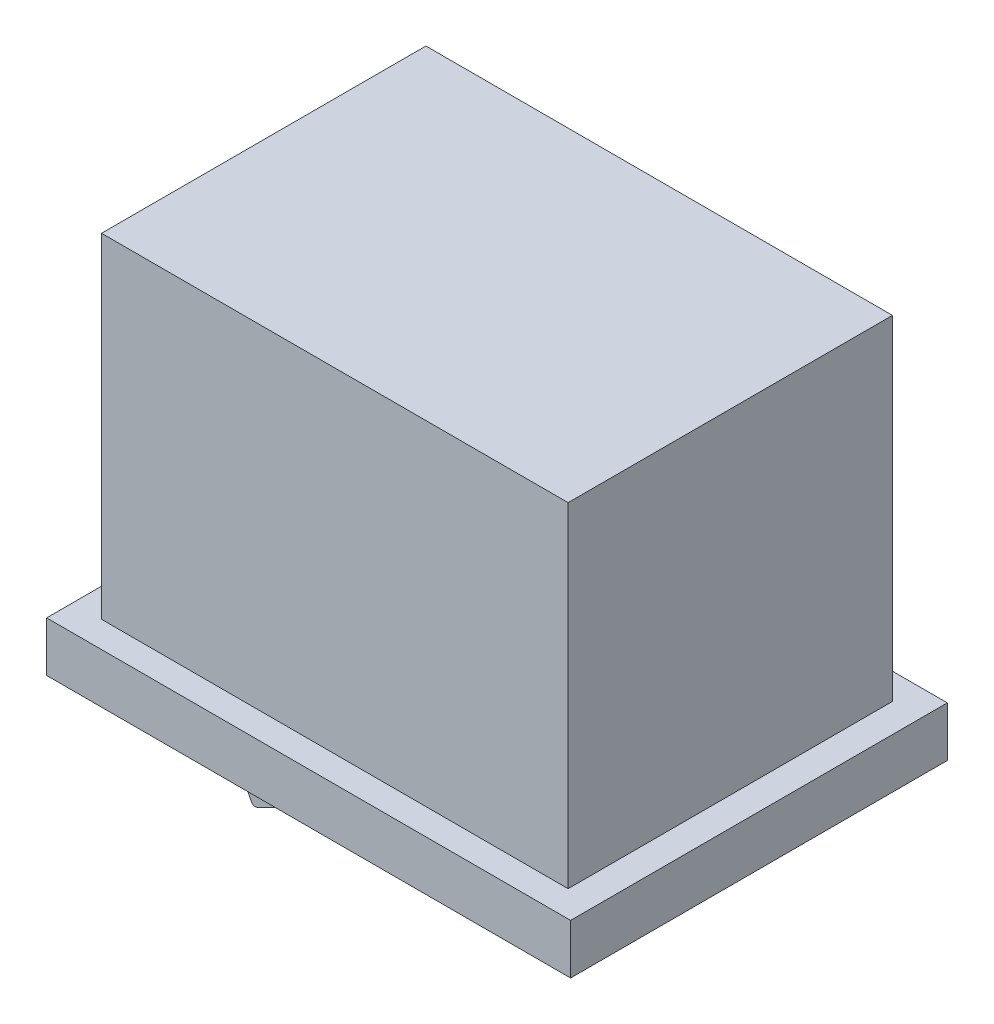
ISO-10303-21;
HEADER;
FILE_DESCRIPTION(('STEP AP214'),'2;1');
FILE_NAME('part.step','',(''),(''),'','','');
FILE_SCHEMA(('AUTOMOTIVE_DESIGN { 1 0 10303 214 1 1 1 1 }'));
ENDSEC;
DATA;
#1=APPLICATION_CONTEXT('core data for automotive mechanical design processes');
#2=APPLICATION_PROTOCOL_DEFINITION('international standard','automotive_design',2000,#1);
#3=PRODUCT_CONTEXT('',#1,'mechanical');
#4=PRODUCT('Part','Part','',(#3));
#5=PRODUCT_RELATED_PRODUCT_CATEGORY('part','',(#4));
#6=PRODUCT_DEFINITION_FORMATION('','',#4);
#7=PRODUCT_DEFINITION_CONTEXT('part definition',#1,'design');
#8=PRODUCT_DEFINITION('design','',#6,#7);
#9=PRODUCT_DEFINITION_SHAPE('','',#8);
#10=(LENGTH_UNIT() NAMED_UNIT(*) SI_UNIT(.MILLI.,.METRE.));
#11=(NAMED_UNIT(*) PLANE_ANGLE_UNIT() SI_UNIT($,.RADIAN.));
#12=(NAMED_UNIT(*) SI_UNIT($,.STERADIAN.) SOLID_ANGLE_UNIT());
#13=UNCERTAINTY_MEASURE_WITH_UNIT(LENGTH_MEASURE(1.E-05),#10,'distance_accuracy_value','');
#14=(GEOMETRIC_REPRESENTATION_CONTEXT(3) GLOBAL_UNCERTAINTY_ASSIGNED_CONTEXT((#13)) GLOBAL_UNIT_ASSIGNED_CONTEXT((#10,
#11,#12)) REPRESENTATION_CONTEXT('',''));
#15=CARTESIAN_POINT('',(0.,0.,0.));
#16=DIRECTION('',(0.,0.,1.));
#17=DIRECTION('',(1.,0.,0.));
#18=AXIS2_PLACEMENT_3D('',#15,#16,#17);
#19=CARTESIAN_POINT('',(0.,-15.4,15.1));
#20=DIRECTION('',(0.,1.,0.));
#21=DIRECTION('',(0.,0.,1.));
#22=AXIS2_PLACEMENT_3D('',#19,#20,#21);
#23=PLANE('',#22);
#24=DIRECTION('',(0.,0.,-1.));
#25=VECTOR('',#24,1.);
#26=CARTESIAN_POINT('',(21.,-15.4,15.1));
#27=LINE('',#26,#25);
#28=CARTESIAN_POINT('',(21.,-15.4,15.1));
#29=VERTEX_POINT('',#28);
#30=CARTESIAN_POINT('',(21.,-15.4,0.));
#31=VERTEX_POINT('',#30);
#32=EDGE_CURVE('E235',#29,#31,#27,.T.);
#33=ORIENTED_EDGE('',*,*,#32,.F.);
#34=DIRECTION('',(1.,0.,0.));
#35=VECTOR('',#34,1.);
#36=CARTESIAN_POINT('',(0.,-15.4,15.1));
#37=LINE('',#36,#35);
#38=CARTESIAN_POINT('',(0.,-15.4,15.1));
#39=VERTEX_POINT('',#38);
#40=EDGE_CURVE('E227',#39,#29,#37,.T.);
#41=ORIENTED_EDGE('',*,*,#40,.F.);
#42=DIRECTION('',(0.,0.,-1.));
#43=VECTOR('',#42,1.);
#44=CARTESIAN_POINT('',(0.,-15.4,15.1));
#45=LINE('',#44,#43);
#46=CARTESIAN_POINT('',(0.,-15.4,0.));
#47=VERTEX_POINT('',#46);
#48=EDGE_CURVE('E247',#39,#47,#45,.T.);
#49=ORIENTED_EDGE('',*,*,#48,.T.);
#50=DIRECTION('',(1.,0.,0.));
#51=VECTOR('',#50,1.);
#52=CARTESIAN_POINT('',(0.,-15.4,0.));
#53=LINE('',#52,#51);
#54=EDGE_CURVE('E238',#47,#31,#53,.T.);
#55=ORIENTED_EDGE('',*,*,#54,.T.);
#56=EDGE_LOOP('',(#33,#41,#49,#55));
#57=FACE_BOUND('',#56,.T.);
#58=DIRECTION('',(-1.,0.,0.));
#59=VECTOR('',#58,1.);
#60=CARTESIAN_POINT('',(1.5,-15.4,12.55));
#61=LINE('',#60,#59);
#62=CARTESIAN_POINT('',(17.2006718763527,-15.4,12.55));
#63=VERTEX_POINT('',#62);
#64=CARTESIAN_POINT('',(4.31818788753446,-15.4,12.55));
#65=VERTEX_POINT('',#64);
#66=EDGE_CURVE('E160',#63,#65,#61,.T.);
#67=ORIENTED_EDGE('',*,*,#66,.F.);
#68=DIRECTION('',(0.,0.,-1.));
#69=VECTOR('',#68,1.);
#70=CARTESIAN_POINT('',(17.2006718763527,-15.4,15.1));
#71=LINE('',#70,#69);
#72=CARTESIAN_POINT('',(17.2006718763527,-15.4,2.55));
#73=VERTEX_POINT('',#72);
#74=EDGE_CURVE('E157',#63,#73,#71,.T.);
#75=ORIENTED_EDGE('',*,*,#74,.T.);
#76=DIRECTION('',(1.,0.,0.));
#77=VECTOR('',#76,1.);
#78=CARTESIAN_POINT('',(1.5,-15.4,2.55));
#79=LINE('',#78,#77);
#80=CARTESIAN_POINT('',(4.31818788753446,-15.4,2.55));
#81=VERTEX_POINT('',#80);
#82=EDGE_CURVE('E152',#81,#73,#79,.T.);
#83=ORIENTED_EDGE('',*,*,#82,.F.);
#84=DIRECTION('',(0.,0.,-1.));
#85=VECTOR('',#84,1.);
#86=CARTESIAN_POINT('',(4.31818788753446,-15.4,15.1));
#87=LINE('',#86,#85);
#88=EDGE_CURVE('E134',#65,#81,#87,.T.);
#89=ORIENTED_EDGE('',*,*,#88,.F.);
#90=EDGE_LOOP('',(#67,#75,#83,#89));
#91=FACE_BOUND('',#90,.T.);
#92=ADVANCED_FACE('F43',(#57,#91),#23,.F.);
#93=CARTESIAN_POINT('',(0.,0.,15.1));
#94=DIRECTION('',(1.,0.,0.));
#95=DIRECTION('',(0.,0.,-1.));
#96=AXIS2_PLACEMENT_3D('',#93,#94,#95);
#97=PLANE('',#96);
#98=DIRECTION('',(0.,-1.,0.));
#99=VECTOR('',#98,1.);
#100=CARTESIAN_POINT('',(0.,0.,15.1));
#101=LINE('',#100,#99);
#102=CARTESIAN_POINT('',(0.,-13.4,15.1));
#103=VERTEX_POINT('',#102);
#104=EDGE_CURVE('E224',#103,#39,#101,.T.);
#105=ORIENTED_EDGE('',*,*,#104,.F.);
#106=DIRECTION('',(0.,0.,1.));
#107=VECTOR('',#106,1.);
#108=CARTESIAN_POINT('',(0.,-13.4,15.1));
#109=LINE('',#108,#107);
#110=CARTESIAN_POINT('',(0.,-13.4,0.));
#111=VERTEX_POINT('',#110);
#112=EDGE_CURVE('E217',#111,#103,#109,.T.);
#113=ORIENTED_EDGE('',*,*,#112,.F.);
#114=DIRECTION('',(0.,-1.,0.));
#115=VECTOR('',#114,1.);
#116=CARTESIAN_POINT('',(0.,0.,0.));
#117=LINE('',#116,#115);
#118=EDGE_CURVE('E223',#111,#47,#117,.T.);
#119=ORIENTED_EDGE('',*,*,#118,.T.);
#120=ORIENTED_EDGE('',*,*,#48,.F.);
#121=EDGE_LOOP('',(#105,#113,#119,#120));
#122=FACE_BOUND('',#121,.T.);
#123=ADVANCED_FACE('F45',(#122),#97,.F.);
#124=CARTESIAN_POINT('',(21.,0.,15.1));
#125=DIRECTION('',(-1.,0.,0.));
#126=DIRECTION('',(0.,0.,1.));
#127=AXIS2_PLACEMENT_3D('',#124,#125,#126);
#128=PLANE('',#127);
#129=DIRECTION('',(0.,1.,0.));
#130=VECTOR('',#129,1.);
#131=CARTESIAN_POINT('',(21.,0.,0.));
#132=LINE('',#131,#130);
#133=CARTESIAN_POINT('',(21.,-13.4,0.));
#134=VERTEX_POINT('',#133);
#135=EDGE_CURVE('E228',#31,#134,#132,.T.);
#136=ORIENTED_EDGE('',*,*,#135,.T.);
#137=DIRECTION('',(0.,0.,-1.));
#138=VECTOR('',#137,1.);
#139=CARTESIAN_POINT('',(21.,-13.4,15.1));
#140=LINE('',#139,#138);
#141=CARTESIAN_POINT('',(21.,-13.4,15.1));
#142=VERTEX_POINT('',#141);
#143=EDGE_CURVE('E203',#142,#134,#140,.T.);
#144=ORIENTED_EDGE('',*,*,#143,.F.);
#145=DIRECTION('',(0.,1.,0.));
#146=VECTOR('',#145,1.);
#147=CARTESIAN_POINT('',(21.,0.,15.1));
#148=LINE('',#147,#146);
#149=EDGE_CURVE('E231',#29,#142,#148,.T.);
#150=ORIENTED_EDGE('',*,*,#149,.F.);
#151=ORIENTED_EDGE('',*,*,#32,.T.);
#152=EDGE_LOOP('',(#136,#144,#150,#151));
#153=FACE_BOUND('',#152,.T.);
#154=ADVANCED_FACE('F315',(#153),#128,.F.);
#155=CARTESIAN_POINT('',(0.,0.,15.1));
#156=DIRECTION('',(0.,0.,1.));
#157=DIRECTION('',(1.,0.,0.));
#158=AXIS2_PLACEMENT_3D('',#155,#156,#157);
#159=PLANE('',#158);
#160=DIRECTION('',(1.,0.,0.));
#161=VECTOR('',#160,1.);
#162=CARTESIAN_POINT('',(0.,-13.4,15.1));
#163=LINE('',#162,#161);
#164=EDGE_CURVE('E220',#103,#142,#163,.T.);
#165=ORIENTED_EDGE('',*,*,#164,.F.);
#166=ORIENTED_EDGE('',*,*,#104,.T.);
#167=ORIENTED_EDGE('',*,*,#40,.T.);
#168=ORIENTED_EDGE('',*,*,#149,.T.);
#169=EDGE_LOOP('',(#165,#166,#167,#168));
#170=FACE_BOUND('',#169,.T.);
#171=ADVANCED_FACE('F312',(#170),#159,.T.);
#172=CARTESIAN_POINT('',(0.,0.,0.));
#173=DIRECTION('',(0.,0.,1.));
#174=DIRECTION('',(1.,0.,0.));
#175=AXIS2_PLACEMENT_3D('',#172,#173,#174);
#176=PLANE('',#175);
#177=ORIENTED_EDGE('',*,*,#118,.F.);
#178=DIRECTION('',(-1.,0.,0.));
#179=VECTOR('',#178,1.);
#180=CARTESIAN_POINT('',(0.,-13.4,0.));
#181=LINE('',#180,#179);
#182=EDGE_CURVE('E214',#134,#111,#181,.T.);
#183=ORIENTED_EDGE('',*,*,#182,.F.);
#184=ORIENTED_EDGE('',*,*,#135,.F.);
#185=ORIENTED_EDGE('',*,*,#54,.F.);
#186=EDGE_LOOP('',(#177,#183,#184,#185));
#187=FACE_BOUND('',#186,.T.);
#188=ADVANCED_FACE('F310',(#187),#176,.F.);
#189=CARTESIAN_POINT('',(0.,-13.4,0.));
#190=DIRECTION('',(0.,-1.,0.));
#191=DIRECTION('',(0.,0.,-1.));
#192=AXIS2_PLACEMENT_3D('',#189,#190,#191);
#193=PLANE('',#192);
#194=DIRECTION('',(0.,0.,-1.));
#195=VECTOR('',#194,1.);
#196=CARTESIAN_POINT('',(19.85,-13.4,1.05));
#197=LINE('',#196,#195);
#198=CARTESIAN_POINT('',(19.85,-13.4,14.05));
#199=VERTEX_POINT('',#198);
#200=CARTESIAN_POINT('',(19.85,-13.4,1.05));
#201=VERTEX_POINT('',#200);
#202=EDGE_CURVE('E170',#199,#201,#197,.T.);
#203=ORIENTED_EDGE('',*,*,#202,.F.);
#204=DIRECTION('',(1.,0.,0.));
#205=VECTOR('',#204,1.);
#206=CARTESIAN_POINT('',(19.85,-13.4,14.05));
#207=LINE('',#206,#205);
#208=CARTESIAN_POINT('',(1.15000000000001,-13.4,14.05));
#209=VERTEX_POINT('',#208);
#210=EDGE_CURVE('E183',#209,#199,#207,.T.);
#211=ORIENTED_EDGE('',*,*,#210,.F.);
#212=DIRECTION('',(0.,0.,1.));
#213=VECTOR('',#212,1.);
#214=CARTESIAN_POINT('',(1.15000000000001,-13.4,1.05));
#215=LINE('',#214,#213);
#216=CARTESIAN_POINT('',(1.15000000000001,-13.4,1.05));
#217=VERTEX_POINT('',#216);
#218=EDGE_CURVE('E179',#217,#209,#215,.T.);
#219=ORIENTED_EDGE('',*,*,#218,.F.);
#220=DIRECTION('',(-1.,0.,0.));
#221=VECTOR('',#220,1.);
#222=CARTESIAN_POINT('',(19.85,-13.4,1.05));
#223=LINE('',#222,#221);
#224=EDGE_CURVE('E174',#201,#217,#223,.T.);
#225=ORIENTED_EDGE('',*,*,#224,.F.);
#226=EDGE_LOOP('',(#203,#211,#219,#225));
#227=FACE_BOUND('',#226,.T.);
#228=ORIENTED_EDGE('',*,*,#143,.T.);
#229=ORIENTED_EDGE('',*,*,#182,.T.);
#230=ORIENTED_EDGE('',*,*,#112,.T.);
#231=ORIENTED_EDGE('',*,*,#164,.T.);
#232=EDGE_LOOP('',(#228,#229,#230,#231));
#233=FACE_BOUND('',#232,.T.);
#234=ADVANCED_FACE('F306',(#227,#233),#193,.F.);
#235=CARTESIAN_POINT('',(19.85,-13.4,1.05));
#236=DIRECTION('',(1.,0.,0.));
#237=DIRECTION('',(0.,0.,-1.));
#238=AXIS2_PLACEMENT_3D('',#235,#236,#237);
#239=PLANE('',#238);
#240=DIRECTION('',(0.,0.,-1.));
#241=VECTOR('',#240,1.);
#242=CARTESIAN_POINT('',(19.85,0.,1.05));
#243=LINE('',#242,#241);
#244=CARTESIAN_POINT('',(19.85,0.,14.05));
#245=VERTEX_POINT('',#244);
#246=CARTESIAN_POINT('',(19.85,0.,1.05));
#247=VERTEX_POINT('',#246);
#248=EDGE_CURVE('E164',#245,#247,#243,.T.);
#249=ORIENTED_EDGE('',*,*,#248,.F.);
#250=DIRECTION('',(0.,1.,0.));
#251=VECTOR('',#250,1.);
#252=CARTESIAN_POINT('',(19.85,-13.4,14.05));
#253=LINE('',#252,#251);
#254=EDGE_CURVE('E200',#199,#245,#253,.T.);
#255=ORIENTED_EDGE('',*,*,#254,.F.);
#256=ORIENTED_EDGE('',*,*,#202,.T.);
#257=DIRECTION('',(0.,1.,0.));
#258=VECTOR('',#257,1.);
#259=CARTESIAN_POINT('',(19.85,-13.4,1.05));
#260=LINE('',#259,#258);
#261=EDGE_CURVE('E187',#201,#247,#260,.T.);
#262=ORIENTED_EDGE('',*,*,#261,.T.);
#263=EDGE_LOOP('',(#249,#255,#256,#262));
#264=FACE_BOUND('',#263,.T.);
#265=ADVANCED_FACE('F296',(#264),#239,.T.);
#266=CARTESIAN_POINT('',(19.85,-13.4,14.05));
#267=DIRECTION('',(0.,0.,1.));
#268=DIRECTION('',(1.,0.,0.));
#269=AXIS2_PLACEMENT_3D('',#266,#267,#268);
#270=PLANE('',#269);
#271=DIRECTION('',(1.,0.,0.));
#272=VECTOR('',#271,1.);
#273=CARTESIAN_POINT('',(19.85,0.,14.05));
#274=LINE('',#273,#272);
#275=CARTESIAN_POINT('',(1.15000000000001,0.,14.05));
#276=VERTEX_POINT('',#275);
#277=EDGE_CURVE('E175',#276,#245,#274,.T.);
#278=ORIENTED_EDGE('',*,*,#277,.F.);
#279=DIRECTION('',(0.,1.,0.));
#280=VECTOR('',#279,1.);
#281=CARTESIAN_POINT('',(1.15000000000001,-13.4,14.05));
#282=LINE('',#281,#280);
#283=EDGE_CURVE('E204',#209,#276,#282,.T.);
#284=ORIENTED_EDGE('',*,*,#283,.F.);
#285=ORIENTED_EDGE('',*,*,#210,.T.);
#286=ORIENTED_EDGE('',*,*,#254,.T.);
#287=EDGE_LOOP('',(#278,#284,#285,#286));
#288=FACE_BOUND('',#287,.T.);
#289=ADVANCED_FACE('F292',(#288),#270,.T.);
#290=CARTESIAN_POINT('',(1.15000000000001,-13.4,1.05));
#291=DIRECTION('',(-1.,0.,0.));
#292=DIRECTION('',(0.,0.,1.));
#293=AXIS2_PLACEMENT_3D('',#290,#291,#292);
#294=PLANE('',#293);
#295=DIRECTION('',(0.,0.,1.));
#296=VECTOR('',#295,1.);
#297=CARTESIAN_POINT('',(1.15000000000001,0.,1.05));
#298=LINE('',#297,#296);
#299=CARTESIAN_POINT('',(1.15000000000001,0.,1.05));
#300=VERTEX_POINT('',#299);
#301=EDGE_CURVE('E69',#300,#276,#298,.T.);
#302=ORIENTED_EDGE('',*,*,#301,.F.);
#303=DIRECTION('',(0.,1.,0.));
#304=VECTOR('',#303,1.);
#305=CARTESIAN_POINT('',(1.15000000000001,-13.4,1.05));
#306=LINE('',#305,#304);
#307=EDGE_CURVE('E207',#217,#300,#306,.T.);
#308=ORIENTED_EDGE('',*,*,#307,.F.);
#309=ORIENTED_EDGE('',*,*,#218,.T.);
#310=ORIENTED_EDGE('',*,*,#283,.T.);
#311=EDGE_LOOP('',(#302,#308,#309,#310));
#312=FACE_BOUND('',#311,.T.);
#313=ADVANCED_FACE('F295',(#312),#294,.T.);
#314=CARTESIAN_POINT('',(19.85,-13.4,1.05));
#315=DIRECTION('',(0.,0.,-1.));
#316=DIRECTION('',(-1.,0.,0.));
#317=AXIS2_PLACEMENT_3D('',#314,#315,#316);
#318=PLANE('',#317);
#319=DIRECTION('',(-1.,0.,0.));
#320=VECTOR('',#319,1.);
#321=CARTESIAN_POINT('',(19.85,0.,1.05));
#322=LINE('',#321,#320);
#323=EDGE_CURVE('E191',#247,#300,#322,.T.);
#324=ORIENTED_EDGE('',*,*,#323,.F.);
#325=ORIENTED_EDGE('',*,*,#261,.F.);
#326=ORIENTED_EDGE('',*,*,#224,.T.);
#327=ORIENTED_EDGE('',*,*,#307,.T.);
#328=EDGE_LOOP('',(#324,#325,#326,#327));
#329=FACE_BOUND('',#328,.T.);
#330=ADVANCED_FACE('F300',(#329),#318,.T.);
#331=CARTESIAN_POINT('',(0.,0.,15.1));
#332=DIRECTION('',(0.,-1.,0.));
#333=DIRECTION('',(0.,0.,-1.));
#334=AXIS2_PLACEMENT_3D('',#331,#332,#333);
#335=PLANE('',#334);
#336=ORIENTED_EDGE('',*,*,#248,.T.);
#337=ORIENTED_EDGE('',*,*,#323,.T.);
#338=ORIENTED_EDGE('',*,*,#301,.T.);
#339=ORIENTED_EDGE('',*,*,#277,.T.);
#340=EDGE_LOOP('',(#336,#337,#338,#339));
#341=FACE_BOUND('',#340,.T.);
#342=ADVANCED_FACE('F291',(#341),#335,.F.);
#343=CARTESIAN_POINT('',(1.5,-18.4,2.55));
#344=DIRECTION('',(0.,0.,1.));
#345=DIRECTION('',(1.,0.,0.));
#346=AXIS2_PLACEMENT_3D('',#343,#344,#345);
#347=PLANE('',#346);
#348=ORIENTED_EDGE('',*,*,#82,.T.);
#349=CARTESIAN_POINT('',(5.91534373956607,-18.3002514179143,2.55));
#350=CARTESIAN_POINT('',(9.41417553791337,-16.4338951216964,2.55));
#351=CARTESIAN_POINT('',(13.1809822914597,-15.4655167849767,2.55));
#352=CARTESIAN_POINT('',(17.2006718763527,-15.4,2.55));
#353=B_SPLINE_CURVE_WITH_KNOTS('',3,(#349,#350,#351,#352),.UNSPECIFIED.,.F.,.F.,(4,4),
(0.0173581708748145,1.),.UNSPECIFIED.);
#354=CARTESIAN_POINT('',(5.91534373956607,-18.3002514179143,2.55));
#355=VERTEX_POINT('',#354);
#356=EDGE_CURVE('E146',#355,#73,#353,.T.);
#357=ORIENTED_EDGE('',*,*,#356,.F.);
#358=CARTESIAN_POINT('',(5.82121381538486,-18.1237873780262,2.55));
#359=DIRECTION('',(0.,0.,1.));
#360=DIRECTION('',(1.,0.,0.));
#361=AXIS2_PLACEMENT_3D('',#358,#359,#360);
#362=CIRCLE('',#361,0.199999999999999);
#363=CARTESIAN_POINT('',(5.64025516027659,-18.2089575907851,2.55));
#364=VERTEX_POINT('',#363);
#365=EDGE_CURVE('E154',#364,#355,#362,.T.);
#366=ORIENTED_EDGE('',*,*,#365,.F.);
#367=DIRECTION('',(0.425851063794813,-0.904793275541339,0.));
#368=VECTOR('',#367,1.);
#369=CARTESIAN_POINT('',(4.31818788753446,-15.4,2.55));
#370=LINE('',#369,#368);
#371=EDGE_CURVE('E137',#81,#364,#370,.T.);
#372=ORIENTED_EDGE('',*,*,#371,.F.);
#373=EDGE_LOOP('',(#348,#357,#366,#372));
#374=FACE_BOUND('',#373,.T.);
#375=ADVANCED_FACE('F150',(#374),#347,.F.);
#376=CARTESIAN_POINT('',(1.5,-18.4,12.55));
#377=DIRECTION('',(0.,0.,-1.));
#378=DIRECTION('',(-1.,0.,0.));
#379=AXIS2_PLACEMENT_3D('',#376,#377,#378);
#380=PLANE('',#379);
#381=CARTESIAN_POINT('',(5.82121381538486,-18.1237873780262,12.55));
#382=DIRECTION('',(0.,0.,-1.));
#383=DIRECTION('',(-1.,0.,0.));
#384=AXIS2_PLACEMENT_3D('',#381,#382,#383);
#385=CIRCLE('',#384,0.199999999999999);
#386=CARTESIAN_POINT('',(5.64025516027659,-18.2089575907851,12.55));
#387=VERTEX_POINT('',#386);
#388=CARTESIAN_POINT('',(5.91534373956607,-18.3002514179143,12.55));
#389=VERTEX_POINT('',#388);
#390=EDGE_CURVE('E54',#387,#389,#385,.F.);
#391=ORIENTED_EDGE('',*,*,#390,.T.);
#392=CARTESIAN_POINT('',(5.91534373956607,-18.3002514179143,12.55));
#393=CARTESIAN_POINT('',(9.41417553791337,-16.4338951216964,12.55));
#394=CARTESIAN_POINT('',(13.1809822914597,-15.4655167849767,12.55));
#395=CARTESIAN_POINT('',(17.2006718763527,-15.4,12.55));
#396=B_SPLINE_CURVE_WITH_KNOTS('',3,(#392,#393,#394,#395),.UNSPECIFIED.,.F.,.F.,(4,4),
(0.0173581708748145,1.),.UNSPECIFIED.);
#397=EDGE_CURVE('E11',#389,#63,#396,.T.);
#398=ORIENTED_EDGE('',*,*,#397,.T.);
#399=ORIENTED_EDGE('',*,*,#66,.T.);
#400=DIRECTION('',(0.425851063794813,-0.904793275541339,0.));
#401=VECTOR('',#400,1.);
#402=CARTESIAN_POINT('',(4.96303350679272,-16.7700845898281,12.55));
#403=LINE('',#402,#401);
#404=EDGE_CURVE('E140',#65,#387,#403,.T.);
#405=ORIENTED_EDGE('',*,*,#404,.T.);
#406=EDGE_LOOP('',(#391,#398,#399,#405));
#407=FACE_BOUND('',#406,.T.);
#408=ADVANCED_FACE('F255',(#407),#380,.F.);
#409=CARTESIAN_POINT('',(5.91534373956607,-18.3002514179143,15.1));
#410=CARTESIAN_POINT('',(9.41417553791337,-16.4338951216964,15.1));
#411=CARTESIAN_POINT('',(13.1809822914597,-15.4655167849767,15.1));
#412=CARTESIAN_POINT('',(17.2006718763527,-15.4,15.1));
#413=B_SPLINE_CURVE_WITH_KNOTS('',3,(#409,#410,#411,#412),.UNSPECIFIED.,.F.,.F.,(4,4),
(0.0173581708748145,1.),.UNSPECIFIED.);
#414=DIRECTION('',(0.,0.,-1.));
#415=VECTOR('',#414,1.);
#416=SURFACE_OF_LINEAR_EXTRUSION('',#413,#415);
#417=DIRECTION('',(0.,0.,-1.));
#418=VECTOR('',#417,1.);
#419=CARTESIAN_POINT('',(5.91534373956607,-18.3002514179143,15.1));
#420=LINE('',#419,#418);
#421=EDGE_CURVE('E166',#389,#355,#420,.T.);
#422=ORIENTED_EDGE('',*,*,#421,.T.);
#423=ORIENTED_EDGE('',*,*,#356,.T.);
#424=ORIENTED_EDGE('',*,*,#74,.F.);
#425=ORIENTED_EDGE('',*,*,#397,.F.);
#426=EDGE_LOOP('',(#422,#423,#424,#425));
#427=FACE_BOUND('',#426,.T.);
#428=ADVANCED_FACE('F280',(#427),#416,.F.);
#429=CARTESIAN_POINT('',(5.82121381538486,-18.1237873780262,15.1));
#430=DIRECTION('',(0.,0.,-1.));
#431=DIRECTION('',(-1.,0.,0.));
#432=AXIS2_PLACEMENT_3D('',#429,#430,#431);
#433=CYLINDRICAL_SURFACE('',#432,0.199999999999999);
#434=DIRECTION('',(0.,0.,-1.));
#435=VECTOR('',#434,1.);
#436=CARTESIAN_POINT('',(5.64025516027659,-18.2089575907851,15.1));
#437=LINE('',#436,#435);
#438=EDGE_CURVE('E61',#387,#364,#437,.T.);
#439=ORIENTED_EDGE('',*,*,#438,.T.);
#440=ORIENTED_EDGE('',*,*,#365,.T.);
#441=ORIENTED_EDGE('',*,*,#421,.F.);
#442=ORIENTED_EDGE('',*,*,#390,.F.);
#443=EDGE_LOOP('',(#439,#440,#441,#442));
#444=FACE_BOUND('',#443,.T.);
#445=ADVANCED_FACE('F258',(#444),#433,.T.);
#446=CARTESIAN_POINT('',(4.31818788753446,-15.4,15.1));
#447=DIRECTION('',(0.904793275541339,0.425851063794813,0.));
#448=DIRECTION('',(-0.425851063794813,0.904793275541339,0.));
#449=AXIS2_PLACEMENT_3D('',#446,#447,#448);
#450=PLANE('',#449);
#451=ORIENTED_EDGE('',*,*,#88,.T.);
#452=ORIENTED_EDGE('',*,*,#371,.T.);
#453=ORIENTED_EDGE('',*,*,#438,.F.);
#454=ORIENTED_EDGE('',*,*,#404,.F.);
#455=EDGE_LOOP('',(#451,#452,#453,#454));
#456=FACE_BOUND('',#455,.T.);
#457=ADVANCED_FACE('F136',(#456),#450,.F.);
#458=CLOSED_SHELL('',(#92,#123,#154,#171,#188,#234,#265,#289,#313,#330,#342,#375,#408,#428,#445,#457));
#459=MANIFOLD_SOLID_BREP('B2',#458);
#460=ADVANCED_BREP_SHAPE_REPRESENTATION('',(#18,#459),#14);
#461=SHAPE_DEFINITION_REPRESENTATION(#9,#460);
ENDSEC;
END-ISO-10303-21;
